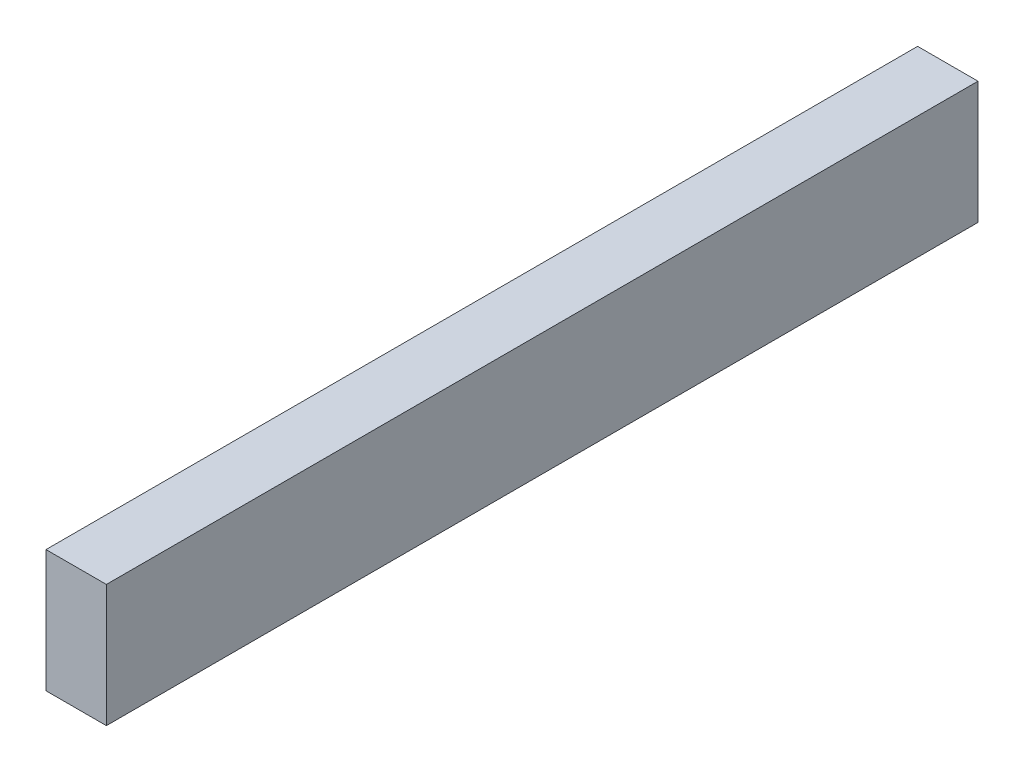
ISO-10303-21;
HEADER;
FILE_DESCRIPTION(('STEP AP214'),'2;1');
FILE_NAME('part.step','',(''),(''),'','','');
FILE_SCHEMA(('AUTOMOTIVE_DESIGN { 1 0 10303 214 1 1 1 1 }'));
ENDSEC;
DATA;
#1=APPLICATION_CONTEXT('core data for automotive mechanical design processes');
#2=APPLICATION_PROTOCOL_DEFINITION('international standard','automotive_design',2000,#1);
#3=PRODUCT_CONTEXT('',#1,'mechanical');
#4=PRODUCT('Part','Part','',(#3));
#5=PRODUCT_RELATED_PRODUCT_CATEGORY('part','',(#4));
#6=PRODUCT_DEFINITION_FORMATION('','',#4);
#7=PRODUCT_DEFINITION_CONTEXT('part definition',#1,'design');
#8=PRODUCT_DEFINITION('design','',#6,#7);
#9=PRODUCT_DEFINITION_SHAPE('','',#8);
#10=(LENGTH_UNIT() NAMED_UNIT(*) SI_UNIT(.MILLI.,.METRE.));
#11=(NAMED_UNIT(*) PLANE_ANGLE_UNIT() SI_UNIT($,.RADIAN.));
#12=(NAMED_UNIT(*) SI_UNIT($,.STERADIAN.) SOLID_ANGLE_UNIT());
#13=UNCERTAINTY_MEASURE_WITH_UNIT(LENGTH_MEASURE(1.E-05),#10,'distance_accuracy_value','');
#14=(GEOMETRIC_REPRESENTATION_CONTEXT(3) GLOBAL_UNCERTAINTY_ASSIGNED_CONTEXT((#13)) GLOBAL_UNIT_ASSIGNED_CONTEXT((#10,
#11,#12)) REPRESENTATION_CONTEXT('',''));
#15=CARTESIAN_POINT('',(0.,0.,0.));
#16=DIRECTION('',(0.,0.,1.));
#17=DIRECTION('',(1.,0.,0.));
#18=AXIS2_PLACEMENT_3D('',#15,#16,#17);
#19=CARTESIAN_POINT('',(10.3904262849751,-21.0495704911133,300.));
#20=DIRECTION('',(-1.,0.,0.));
#21=DIRECTION('',(0.,0.,1.));
#22=AXIS2_PLACEMENT_3D('',#19,#20,#21);
#23=PLANE('',#22);
#24=DIRECTION('',(0.,1.,0.));
#25=VECTOR('',#24,1.);
#26=CARTESIAN_POINT('',(10.3904262849751,-21.0495704911133,0.));
#27=LINE('',#26,#25);
#28=CARTESIAN_POINT('',(10.3904262849751,-21.0495704911133,0.));
#29=VERTEX_POINT('',#28);
#30=CARTESIAN_POINT('',(10.3904262849751,21.0495704911133,0.));
#31=VERTEX_POINT('',#30);
#32=EDGE_CURVE('E109',#29,#31,#27,.T.);
#33=ORIENTED_EDGE('',*,*,#32,.T.);
#34=DIRECTION('',(0.,0.,-1.));
#35=VECTOR('',#34,1.);
#36=CARTESIAN_POINT('',(10.3904262849751,21.0495704911133,300.));
#37=LINE('',#36,#35);
#38=CARTESIAN_POINT('',(10.3904262849751,21.0495704911133,300.));
#39=VERTEX_POINT('',#38);
#40=EDGE_CURVE('E11',#39,#31,#37,.T.);
#41=ORIENTED_EDGE('',*,*,#40,.F.);
#42=DIRECTION('',(0.,1.,0.));
#43=VECTOR('',#42,1.);
#44=CARTESIAN_POINT('',(10.3904262849751,-21.0495704911133,300.));
#45=LINE('',#44,#43);
#46=CARTESIAN_POINT('',(10.3904262849751,-21.0495704911133,300.));
#47=VERTEX_POINT('',#46);
#48=EDGE_CURVE('E96',#47,#39,#45,.T.);
#49=ORIENTED_EDGE('',*,*,#48,.F.);
#50=DIRECTION('',(0.,0.,-1.));
#51=VECTOR('',#50,1.);
#52=CARTESIAN_POINT('',(10.3904262849751,-21.0495704911133,300.));
#53=LINE('',#52,#51);
#54=EDGE_CURVE('E105',#47,#29,#53,.T.);
#55=ORIENTED_EDGE('',*,*,#54,.T.);
#56=EDGE_LOOP('',(#33,#41,#49,#55));
#57=FACE_BOUND('',#56,.T.);
#58=ADVANCED_FACE('F43',(#57),#23,.F.);
#59=CARTESIAN_POINT('',(-10.3904262849751,21.0495704911133,300.));
#60=DIRECTION('',(0.,-1.,0.));
#61=DIRECTION('',(0.,0.,-1.));
#62=AXIS2_PLACEMENT_3D('',#59,#60,#61);
#63=PLANE('',#62);
#64=DIRECTION('',(-1.,0.,0.));
#65=VECTOR('',#64,1.);
#66=CARTESIAN_POINT('',(-10.3904262849751,21.0495704911133,0.));
#67=LINE('',#66,#65);
#68=CARTESIAN_POINT('',(-10.3904262849751,21.0495704911133,0.));
#69=VERTEX_POINT('',#68);
#70=EDGE_CURVE('E100',#31,#69,#67,.T.);
#71=ORIENTED_EDGE('',*,*,#70,.T.);
#72=DIRECTION('',(0.,0.,-1.));
#73=VECTOR('',#72,1.);
#74=CARTESIAN_POINT('',(-10.3904262849751,21.0495704911133,300.));
#75=LINE('',#74,#73);
#76=CARTESIAN_POINT('',(-10.3904262849751,21.0495704911133,300.));
#77=VERTEX_POINT('',#76);
#78=EDGE_CURVE('E52',#77,#69,#75,.T.);
#79=ORIENTED_EDGE('',*,*,#78,.F.);
#80=DIRECTION('',(-1.,0.,0.));
#81=VECTOR('',#80,1.);
#82=CARTESIAN_POINT('',(-10.3904262849751,21.0495704911133,300.));
#83=LINE('',#82,#81);
#84=EDGE_CURVE('E91',#39,#77,#83,.T.);
#85=ORIENTED_EDGE('',*,*,#84,.F.);
#86=ORIENTED_EDGE('',*,*,#40,.T.);
#87=EDGE_LOOP('',(#71,#79,#85,#86));
#88=FACE_BOUND('',#87,.T.);
#89=ADVANCED_FACE('F99',(#88),#63,.F.);
#90=CARTESIAN_POINT('',(-10.3904262849751,-21.0495704911133,300.));
#91=DIRECTION('',(1.,0.,0.));
#92=DIRECTION('',(0.,0.,-1.));
#93=AXIS2_PLACEMENT_3D('',#90,#91,#92);
#94=PLANE('',#93);
#95=DIRECTION('',(0.,-1.,0.));
#96=VECTOR('',#95,1.);
#97=CARTESIAN_POINT('',(-10.3904262849751,-21.0495704911133,0.));
#98=LINE('',#97,#96);
#99=CARTESIAN_POINT('',(-10.3904262849751,-21.0495704911133,0.));
#100=VERTEX_POINT('',#99);
#101=EDGE_CURVE('E78',#69,#100,#98,.T.);
#102=ORIENTED_EDGE('',*,*,#101,.T.);
#103=DIRECTION('',(0.,0.,-1.));
#104=VECTOR('',#103,1.);
#105=CARTESIAN_POINT('',(-10.3904262849751,-21.0495704911133,300.));
#106=LINE('',#105,#104);
#107=CARTESIAN_POINT('',(-10.3904262849751,-21.0495704911133,300.));
#108=VERTEX_POINT('',#107);
#109=EDGE_CURVE('E102',#108,#100,#106,.T.);
#110=ORIENTED_EDGE('',*,*,#109,.F.);
#111=DIRECTION('',(0.,-1.,0.));
#112=VECTOR('',#111,1.);
#113=CARTESIAN_POINT('',(-10.3904262849751,-21.0495704911133,300.));
#114=LINE('',#113,#112);
#115=EDGE_CURVE('E94',#77,#108,#114,.T.);
#116=ORIENTED_EDGE('',*,*,#115,.F.);
#117=ORIENTED_EDGE('',*,*,#78,.T.);
#118=EDGE_LOOP('',(#102,#110,#116,#117));
#119=FACE_BOUND('',#118,.T.);
#120=ADVANCED_FACE('F103',(#119),#94,.F.);
#121=CARTESIAN_POINT('',(-10.3904262849751,-21.0495704911133,300.));
#122=DIRECTION('',(0.,1.,0.));
#123=DIRECTION('',(0.,0.,1.));
#124=AXIS2_PLACEMENT_3D('',#121,#122,#123);
#125=PLANE('',#124);
#126=DIRECTION('',(1.,0.,0.));
#127=VECTOR('',#126,1.);
#128=CARTESIAN_POINT('',(-10.3904262849751,-21.0495704911133,0.));
#129=LINE('',#128,#127);
#130=EDGE_CURVE('E84',#100,#29,#129,.T.);
#131=ORIENTED_EDGE('',*,*,#130,.T.);
#132=ORIENTED_EDGE('',*,*,#54,.F.);
#133=DIRECTION('',(1.,0.,0.));
#134=VECTOR('',#133,1.);
#135=CARTESIAN_POINT('',(-10.3904262849751,-21.0495704911133,300.));
#136=LINE('',#135,#134);
#137=EDGE_CURVE('E60',#108,#47,#136,.T.);
#138=ORIENTED_EDGE('',*,*,#137,.F.);
#139=ORIENTED_EDGE('',*,*,#109,.T.);
#140=EDGE_LOOP('',(#131,#132,#138,#139));
#141=FACE_BOUND('',#140,.T.);
#142=ADVANCED_FACE('F119',(#141),#125,.F.);
#143=CARTESIAN_POINT('',(0.,0.,300.));
#144=DIRECTION('',(0.,0.,-1.));
#145=DIRECTION('',(-1.,0.,0.));
#146=AXIS2_PLACEMENT_3D('',#143,#144,#145);
#147=PLANE('',#146);
#148=ORIENTED_EDGE('',*,*,#48,.T.);
#149=ORIENTED_EDGE('',*,*,#84,.T.);
#150=ORIENTED_EDGE('',*,*,#115,.T.);
#151=ORIENTED_EDGE('',*,*,#137,.T.);
#152=EDGE_LOOP('',(#148,#149,#150,#151));
#153=FACE_BOUND('',#152,.T.);
#154=ADVANCED_FACE('F92',(#153),#147,.F.);
#155=CARTESIAN_POINT('',(0.,0.,0.));
#156=DIRECTION('',(0.,0.,-1.));
#157=DIRECTION('',(-1.,0.,0.));
#158=AXIS2_PLACEMENT_3D('',#155,#156,#157);
#159=PLANE('',#158);
#160=ORIENTED_EDGE('',*,*,#32,.F.);
#161=ORIENTED_EDGE('',*,*,#130,.F.);
#162=ORIENTED_EDGE('',*,*,#101,.F.);
#163=ORIENTED_EDGE('',*,*,#70,.F.);
#164=EDGE_LOOP('',(#160,#161,#162,#163));
#165=FACE_BOUND('',#164,.T.);
#166=ADVANCED_FACE('F122',(#165),#159,.T.);
#167=CLOSED_SHELL('',(#58,#89,#120,#142,#154,#166));
#168=MANIFOLD_SOLID_BREP('B2',#167);
#169=ADVANCED_BREP_SHAPE_REPRESENTATION('',(#18,#168),#14);
#170=SHAPE_DEFINITION_REPRESENTATION(#9,#169);
ENDSEC;
END-ISO-10303-21;
